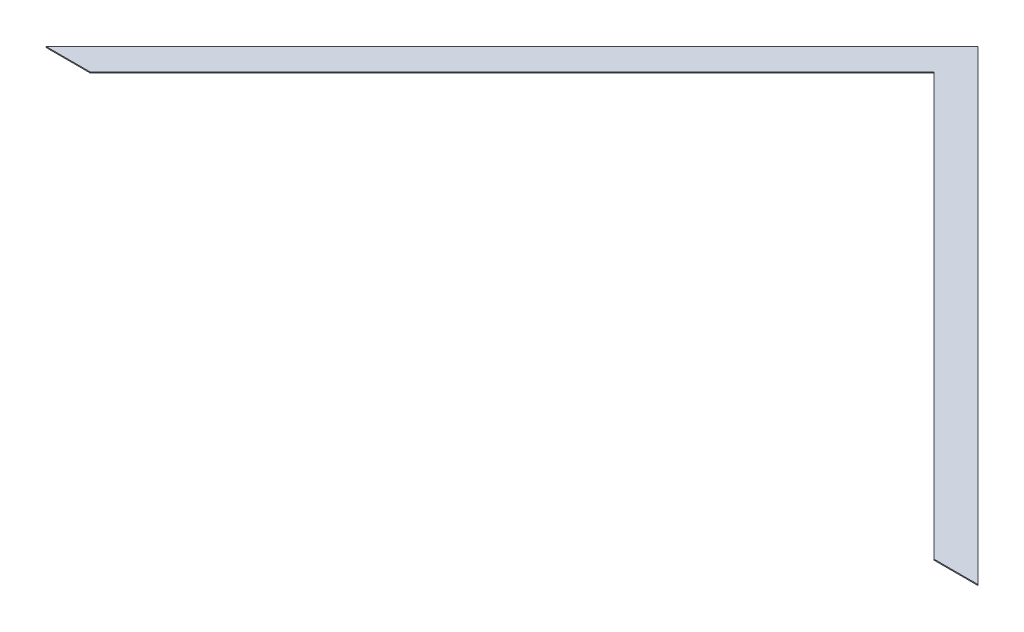
ISO-10303-21;
HEADER;
FILE_DESCRIPTION(('STEP AP214'),'2;1');
FILE_NAME('part.step','',(''),(''),'','','');
FILE_SCHEMA(('AUTOMOTIVE_DESIGN { 1 0 10303 214 1 1 1 1 }'));
ENDSEC;
DATA;
#1=APPLICATION_CONTEXT('core data for automotive mechanical design processes');
#2=APPLICATION_PROTOCOL_DEFINITION('international standard','automotive_design',2000,#1);
#3=PRODUCT_CONTEXT('',#1,'mechanical');
#4=PRODUCT('Part','Part','',(#3));
#5=PRODUCT_RELATED_PRODUCT_CATEGORY('part','',(#4));
#6=PRODUCT_DEFINITION_FORMATION('','',#4);
#7=PRODUCT_DEFINITION_CONTEXT('part definition',#1,'design');
#8=PRODUCT_DEFINITION('design','',#6,#7);
#9=PRODUCT_DEFINITION_SHAPE('','',#8);
#10=(LENGTH_UNIT() NAMED_UNIT(*) SI_UNIT(.MILLI.,.METRE.));
#11=(NAMED_UNIT(*) PLANE_ANGLE_UNIT() SI_UNIT($,.RADIAN.));
#12=(NAMED_UNIT(*) SI_UNIT($,.STERADIAN.) SOLID_ANGLE_UNIT());
#13=UNCERTAINTY_MEASURE_WITH_UNIT(LENGTH_MEASURE(1.E-05),#10,'distance_accuracy_value','');
#14=(GEOMETRIC_REPRESENTATION_CONTEXT(3) GLOBAL_UNCERTAINTY_ASSIGNED_CONTEXT((#13)) GLOBAL_UNIT_ASSIGNED_CONTEXT((#10,
#11,#12)) REPRESENTATION_CONTEXT('',''));
#15=CARTESIAN_POINT('',(0.,0.,0.));
#16=DIRECTION('',(0.,0.,1.));
#17=DIRECTION('',(1.,0.,0.));
#18=AXIS2_PLACEMENT_3D('',#15,#16,#17);
#19=CARTESIAN_POINT('',(71.8420489685525,1.5875,0.));
#20=DIRECTION('',(0.,0.,-1.));
#21=DIRECTION('',(-1.,0.,0.));
#22=AXIS2_PLACEMENT_3D('',#19,#20,#21);
#23=PLANE('',#22);
#24=DIRECTION('',(1.,0.,0.));
#25=VECTOR('',#24,1.);
#26=CARTESIAN_POINT('',(71.8420489685525,0.,0.));
#27=LINE('',#26,#25);
#28=CARTESIAN_POINT('',(0.,0.,0.));
#29=VERTEX_POINT('',#28);
#30=CARTESIAN_POINT('',(71.8420489685525,0.,0.));
#31=VERTEX_POINT('',#30);
#32=EDGE_CURVE('E116',#29,#31,#27,.T.);
#33=ORIENTED_EDGE('',*,*,#32,.T.);
#34=DIRECTION('',(0.,-1.,0.));
#35=VECTOR('',#34,1.);
#36=CARTESIAN_POINT('',(71.8420489685525,1.5875,0.));
#37=LINE('',#36,#35);
#38=CARTESIAN_POINT('',(71.8420489685525,1.5875,0.));
#39=VERTEX_POINT('',#38);
#40=EDGE_CURVE('E11',#39,#31,#37,.T.);
#41=ORIENTED_EDGE('',*,*,#40,.F.);
#42=DIRECTION('',(1.,0.,0.));
#43=VECTOR('',#42,1.);
#44=CARTESIAN_POINT('',(71.8420489685525,1.5875,0.));
#45=LINE('',#44,#43);
#46=CARTESIAN_POINT('',(0.,1.5875,0.));
#47=VERTEX_POINT('',#46);
#48=EDGE_CURVE('E126',#47,#39,#45,.T.);
#49=ORIENTED_EDGE('',*,*,#48,.F.);
#50=DIRECTION('',(0.,-1.,0.));
#51=VECTOR('',#50,1.);
#52=CARTESIAN_POINT('',(0.,1.5875,0.));
#53=LINE('',#52,#51);
#54=EDGE_CURVE('E112',#47,#29,#53,.T.);
#55=ORIENTED_EDGE('',*,*,#54,.T.);
#56=EDGE_LOOP('',(#33,#41,#49,#55));
#57=FACE_BOUND('',#56,.T.);
#58=ADVANCED_FACE('F32',(#57),#23,.F.);
#59=CARTESIAN_POINT('',(762.,1.5875,-690.15795103145));
#60=DIRECTION('',(-0.707106781186549,0.,-0.707106781186546));
#61=DIRECTION('',(-0.707106781186546,0.,0.707106781186549));
#62=AXIS2_PLACEMENT_3D('',#59,#60,#61);
#63=PLANE('',#62);
#64=DIRECTION('',(0.707106781186546,0.,-0.707106781186549));
#65=VECTOR('',#64,1.);
#66=CARTESIAN_POINT('',(762.,0.,-690.15795103145));
#67=LINE('',#66,#65);
#68=CARTESIAN_POINT('',(762.,0.,-690.15795103145));
#69=VERTEX_POINT('',#68);
#70=EDGE_CURVE('E119',#31,#69,#67,.T.);
#71=ORIENTED_EDGE('',*,*,#70,.T.);
#72=DIRECTION('',(0.,-1.,0.));
#73=VECTOR('',#72,1.);
#74=CARTESIAN_POINT('',(762.,1.5875,-690.15795103145));
#75=LINE('',#74,#73);
#76=CARTESIAN_POINT('',(762.,1.5875,-690.15795103145));
#77=VERTEX_POINT('',#76);
#78=EDGE_CURVE('E40',#77,#69,#75,.T.);
#79=ORIENTED_EDGE('',*,*,#78,.F.);
#80=DIRECTION('',(0.707106781186546,0.,-0.707106781186549));
#81=VECTOR('',#80,1.);
#82=CARTESIAN_POINT('',(762.,1.5875,-690.15795103145));
#83=LINE('',#82,#81);
#84=EDGE_CURVE('E85',#39,#77,#83,.T.);
#85=ORIENTED_EDGE('',*,*,#84,.F.);
#86=ORIENTED_EDGE('',*,*,#40,.T.);
#87=EDGE_LOOP('',(#71,#79,#85,#86));
#88=FACE_BOUND('',#87,.T.);
#89=ADVANCED_FACE('F150',(#88),#63,.F.);
#90=CARTESIAN_POINT('',(1452.15795103145,1.5875,-1.70774668603328E-13));
#91=DIRECTION('',(0.707106781186548,0.,-0.707106781186546));
#92=DIRECTION('',(-0.707106781186547,0.,-0.707106781186549));
#93=AXIS2_PLACEMENT_3D('',#90,#91,#92);
#94=PLANE('',#93);
#95=DIRECTION('',(0.707106781186546,0.,0.707106781186548));
#96=VECTOR('',#95,1.);
#97=CARTESIAN_POINT('',(1452.15795103145,0.,-1.70774668603328E-13));
#98=LINE('',#97,#96);
#99=CARTESIAN_POINT('',(1452.15795103145,0.,-1.70774668603328E-13));
#100=VERTEX_POINT('',#99);
#101=EDGE_CURVE('E121',#69,#100,#98,.T.);
#102=ORIENTED_EDGE('',*,*,#101,.T.);
#103=DIRECTION('',(0.,-1.,0.));
#104=VECTOR('',#103,1.);
#105=CARTESIAN_POINT('',(1452.15795103145,1.5875,-1.70774668603328E-13));
#106=LINE('',#105,#104);
#107=CARTESIAN_POINT('',(1452.15795103145,1.5875,-1.70774668603328E-13));
#108=VERTEX_POINT('',#107);
#109=EDGE_CURVE('E107',#108,#100,#106,.T.);
#110=ORIENTED_EDGE('',*,*,#109,.F.);
#111=DIRECTION('',(0.707106781186546,0.,0.707106781186548));
#112=VECTOR('',#111,1.);
#113=CARTESIAN_POINT('',(1452.15795103145,1.5875,-1.70774668603328E-13));
#114=LINE('',#113,#112);
#115=EDGE_CURVE('E98',#77,#108,#114,.T.);
#116=ORIENTED_EDGE('',*,*,#115,.F.);
#117=ORIENTED_EDGE('',*,*,#78,.T.);
#118=EDGE_LOOP('',(#102,#110,#116,#117));
#119=FACE_BOUND('',#118,.T.);
#120=ADVANCED_FACE('F132',(#119),#94,.F.);
#121=CARTESIAN_POINT('',(1524.,1.5875,-1.86636172190057E-13));
#122=DIRECTION('',(0.,0.,-1.));
#123=DIRECTION('',(-1.,0.,0.));
#124=AXIS2_PLACEMENT_3D('',#121,#122,#123);
#125=PLANE('',#124);
#126=DIRECTION('',(1.,0.,0.));
#127=VECTOR('',#126,1.);
#128=CARTESIAN_POINT('',(1524.,0.,-1.86636172190057E-13));
#129=LINE('',#128,#127);
#130=CARTESIAN_POINT('',(1524.,0.,-1.86636172190057E-13));
#131=VERTEX_POINT('',#130);
#132=EDGE_CURVE('E106',#100,#131,#129,.T.);
#133=ORIENTED_EDGE('',*,*,#132,.T.);
#134=DIRECTION('',(0.,-1.,0.));
#135=VECTOR('',#134,1.);
#136=CARTESIAN_POINT('',(1524.,1.5875,-1.86636172190057E-13));
#137=LINE('',#136,#135);
#138=CARTESIAN_POINT('',(1524.,1.5875,-1.86636172190057E-13));
#139=VERTEX_POINT('',#138);
#140=EDGE_CURVE('E103',#139,#131,#137,.T.);
#141=ORIENTED_EDGE('',*,*,#140,.F.);
#142=DIRECTION('',(1.,0.,0.));
#143=VECTOR('',#142,1.);
#144=CARTESIAN_POINT('',(1524.,1.5875,-1.86636172190057E-13));
#145=LINE('',#144,#143);
#146=EDGE_CURVE('E92',#108,#139,#145,.T.);
#147=ORIENTED_EDGE('',*,*,#146,.F.);
#148=ORIENTED_EDGE('',*,*,#109,.T.);
#149=EDGE_LOOP('',(#133,#141,#147,#148));
#150=FACE_BOUND('',#149,.T.);
#151=ADVANCED_FACE('F104',(#150),#125,.F.);
#152=CARTESIAN_POINT('',(762.,1.5875,-762.000000000003));
#153=DIRECTION('',(-0.707106781186549,0.,0.707106781186546));
#154=DIRECTION('',(0.707106781186546,0.,0.707106781186549));
#155=AXIS2_PLACEMENT_3D('',#152,#153,#154);
#156=PLANE('',#155);
#157=DIRECTION('',(-0.707106781186546,0.,-0.707106781186549));
#158=VECTOR('',#157,1.);
#159=CARTESIAN_POINT('',(762.,0.,-762.000000000003));
#160=LINE('',#159,#158);
#161=CARTESIAN_POINT('',(762.,0.,-762.000000000003));
#162=VERTEX_POINT('',#161);
#163=EDGE_CURVE('E71',#131,#162,#160,.T.);
#164=ORIENTED_EDGE('',*,*,#163,.T.);
#165=DIRECTION('',(0.,-1.,0.));
#166=VECTOR('',#165,1.);
#167=CARTESIAN_POINT('',(762.,1.5875,-762.000000000003));
#168=LINE('',#167,#166);
#169=CARTESIAN_POINT('',(762.,1.5875,-762.000000000003));
#170=VERTEX_POINT('',#169);
#171=EDGE_CURVE('E108',#170,#162,#168,.T.);
#172=ORIENTED_EDGE('',*,*,#171,.F.);
#173=DIRECTION('',(-0.707106781186546,0.,-0.707106781186549));
#174=VECTOR('',#173,1.);
#175=CARTESIAN_POINT('',(762.,1.5875,-762.000000000003));
#176=LINE('',#175,#174);
#177=EDGE_CURVE('E96',#139,#170,#176,.T.);
#178=ORIENTED_EDGE('',*,*,#177,.F.);
#179=ORIENTED_EDGE('',*,*,#140,.T.);
#180=EDGE_LOOP('',(#164,#172,#178,#179));
#181=FACE_BOUND('',#180,.T.);
#182=ADVANCED_FACE('F110',(#181),#156,.F.);
#183=CARTESIAN_POINT('',(0.,1.5875,0.));
#184=DIRECTION('',(0.707106781186549,0.,0.707106781186546));
#185=DIRECTION('',(0.707106781186546,0.,-0.707106781186549));
#186=AXIS2_PLACEMENT_3D('',#183,#184,#185);
#187=PLANE('',#186);
#188=DIRECTION('',(-0.707106781186546,0.,0.707106781186549));
#189=VECTOR('',#188,1.);
#190=CARTESIAN_POINT('',(0.,0.,0.));
#191=LINE('',#190,#189);
#192=EDGE_CURVE('E77',#162,#29,#191,.T.);
#193=ORIENTED_EDGE('',*,*,#192,.T.);
#194=ORIENTED_EDGE('',*,*,#54,.F.);
#195=DIRECTION('',(-0.707106781186546,0.,0.707106781186549));
#196=VECTOR('',#195,1.);
#197=CARTESIAN_POINT('',(0.,1.5875,0.));
#198=LINE('',#197,#196);
#199=EDGE_CURVE('E48',#170,#47,#198,.T.);
#200=ORIENTED_EDGE('',*,*,#199,.F.);
#201=ORIENTED_EDGE('',*,*,#171,.T.);
#202=EDGE_LOOP('',(#193,#194,#200,#201));
#203=FACE_BOUND('',#202,.T.);
#204=ADVANCED_FACE('F139',(#203),#187,.F.);
#205=CARTESIAN_POINT('',(0.,1.5875,0.));
#206=DIRECTION('',(0.,-1.,0.));
#207=DIRECTION('',(0.,0.,-1.));
#208=AXIS2_PLACEMENT_3D('',#205,#206,#207);
#209=PLANE('',#208);
#210=ORIENTED_EDGE('',*,*,#48,.T.);
#211=ORIENTED_EDGE('',*,*,#84,.T.);
#212=ORIENTED_EDGE('',*,*,#115,.T.);
#213=ORIENTED_EDGE('',*,*,#146,.T.);
#214=ORIENTED_EDGE('',*,*,#177,.T.);
#215=ORIENTED_EDGE('',*,*,#199,.T.);
#216=EDGE_LOOP('',(#210,#211,#212,#213,#214,#215));
#217=FACE_BOUND('',#216,.T.);
#218=ADVANCED_FACE('F94',(#217),#209,.F.);
#219=CARTESIAN_POINT('',(0.,0.,0.));
#220=DIRECTION('',(0.,-1.,0.));
#221=DIRECTION('',(0.,0.,-1.));
#222=AXIS2_PLACEMENT_3D('',#219,#220,#221);
#223=PLANE('',#222);
#224=ORIENTED_EDGE('',*,*,#32,.F.);
#225=ORIENTED_EDGE('',*,*,#192,.F.);
#226=ORIENTED_EDGE('',*,*,#163,.F.);
#227=ORIENTED_EDGE('',*,*,#132,.F.);
#228=ORIENTED_EDGE('',*,*,#101,.F.);
#229=ORIENTED_EDGE('',*,*,#70,.F.);
#230=EDGE_LOOP('',(#224,#225,#226,#227,#228,#229));
#231=FACE_BOUND('',#230,.T.);
#232=ADVANCED_FACE('F135',(#231),#223,.T.);
#233=CLOSED_SHELL('',(#58,#89,#120,#151,#182,#204,#218,#232));
#234=MANIFOLD_SOLID_BREP('B2',#233);
#235=ADVANCED_BREP_SHAPE_REPRESENTATION('',(#18,#234),#14);
#236=SHAPE_DEFINITION_REPRESENTATION(#9,#235);
ENDSEC;
END-ISO-10303-21;
